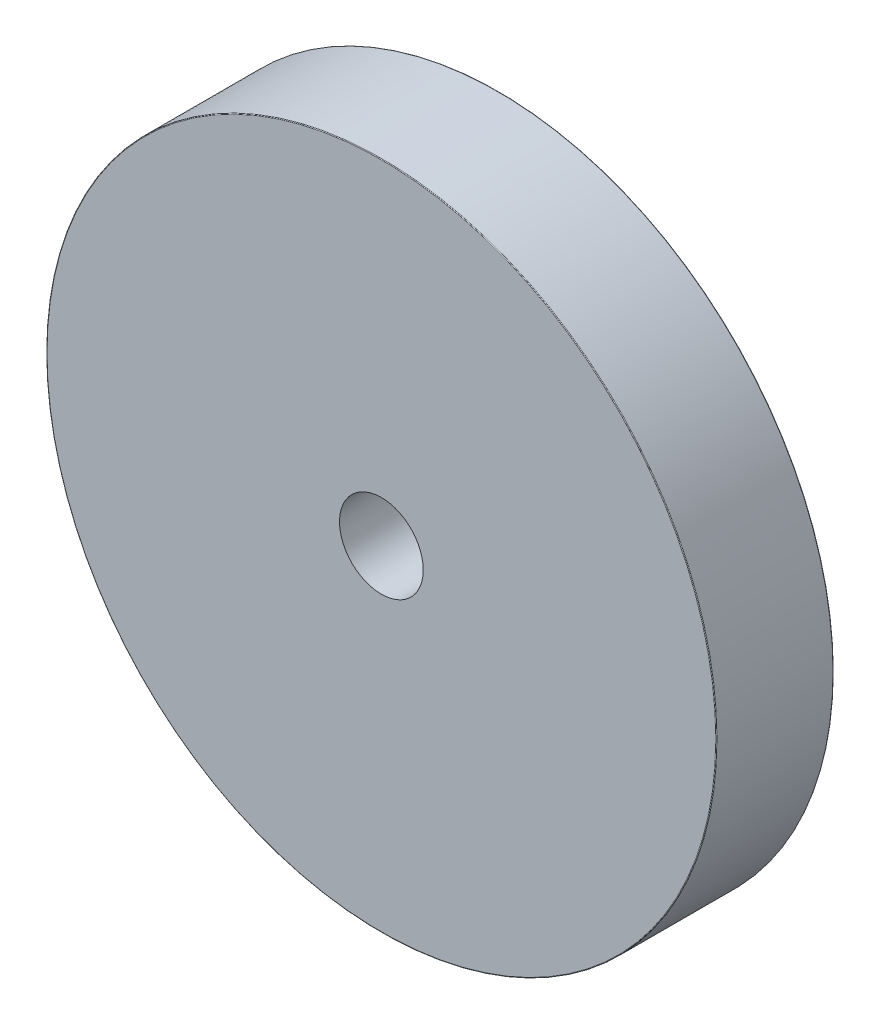
ISO-10303-21;
HEADER;
FILE_DESCRIPTION(('STEP AP214'),'2;1');
FILE_NAME('part.step','',(''),(''),'','','');
FILE_SCHEMA(('AUTOMOTIVE_DESIGN { 1 0 10303 214 1 1 1 1 }'));
ENDSEC;
DATA;
#1=APPLICATION_CONTEXT('core data for automotive mechanical design processes');
#2=APPLICATION_PROTOCOL_DEFINITION('international standard','automotive_design',2000,#1);
#3=PRODUCT_CONTEXT('',#1,'mechanical');
#4=PRODUCT('Part','Part','',(#3));
#5=PRODUCT_RELATED_PRODUCT_CATEGORY('part','',(#4));
#6=PRODUCT_DEFINITION_FORMATION('','',#4);
#7=PRODUCT_DEFINITION_CONTEXT('part definition',#1,'design');
#8=PRODUCT_DEFINITION('design','',#6,#7);
#9=PRODUCT_DEFINITION_SHAPE('','',#8);
#10=(LENGTH_UNIT() NAMED_UNIT(*) SI_UNIT(.MILLI.,.METRE.));
#11=(NAMED_UNIT(*) PLANE_ANGLE_UNIT() SI_UNIT($,.RADIAN.));
#12=(NAMED_UNIT(*) SI_UNIT($,.STERADIAN.) SOLID_ANGLE_UNIT());
#13=UNCERTAINTY_MEASURE_WITH_UNIT(LENGTH_MEASURE(1.E-05),#10,'distance_accuracy_value','');
#14=(GEOMETRIC_REPRESENTATION_CONTEXT(3) GLOBAL_UNCERTAINTY_ASSIGNED_CONTEXT((#13)) GLOBAL_UNIT_ASSIGNED_CONTEXT((#10,
#11,#12)) REPRESENTATION_CONTEXT('',''));
#15=CARTESIAN_POINT('',(0.,0.,0.));
#16=DIRECTION('',(0.,0.,1.));
#17=DIRECTION('',(1.,0.,0.));
#18=AXIS2_PLACEMENT_3D('',#15,#16,#17);
#19=CARTESIAN_POINT('',(0.,0.,4.445));
#20=DIRECTION('',(0.,0.,1.));
#21=DIRECTION('',(1.,0.,0.));
#22=AXIS2_PLACEMENT_3D('',#19,#20,#21);
#23=PLANE('',#22);
#24=CARTESIAN_POINT('',(0.,0.,4.445));
#25=DIRECTION('',(0.,0.,1.));
#26=DIRECTION('',(1.,0.,0.));
#27=AXIS2_PLACEMENT_3D('',#24,#25,#26);
#28=CIRCLE('',#27,12.6746);
#29=CARTESIAN_POINT('',(12.6746,0.,4.445));
#30=VERTEX_POINT('',#29);
#31=EDGE_CURVE('E10',#30,#30,#28,.T.);
#32=ORIENTED_EDGE('',*,*,#31,.T.);
#33=EDGE_LOOP('',(#32));
#34=FACE_BOUND('',#33,.T.);
#35=CARTESIAN_POINT('',(0.,0.,4.445));
#36=DIRECTION('',(0.,0.,1.));
#37=DIRECTION('',(1.,0.,0.));
#38=AXIS2_PLACEMENT_3D('',#35,#36,#37);
#39=CIRCLE('',#38,1.5875);
#40=CARTESIAN_POINT('',(1.5875,0.,4.445));
#41=VERTEX_POINT('',#40);
#42=EDGE_CURVE('E51',#41,#41,#39,.T.);
#43=ORIENTED_EDGE('',*,*,#42,.F.);
#44=EDGE_LOOP('',(#43));
#45=FACE_BOUND('',#44,.T.);
#46=ADVANCED_FACE('F31',(#34,#45),#23,.T.);
#47=CARTESIAN_POINT('',(0.,0.,0.));
#48=DIRECTION('',(0.,0.,1.));
#49=DIRECTION('',(1.,0.,0.));
#50=AXIS2_PLACEMENT_3D('',#47,#48,#49);
#51=PLANE('',#50);
#52=CARTESIAN_POINT('',(0.,0.,0.));
#53=DIRECTION('',(0.,0.,1.));
#54=DIRECTION('',(1.,0.,0.));
#55=AXIS2_PLACEMENT_3D('',#52,#53,#54);
#56=CIRCLE('',#55,12.6746);
#57=CARTESIAN_POINT('',(12.6746,0.,0.));
#58=VERTEX_POINT('',#57);
#59=EDGE_CURVE('E38',#58,#58,#56,.F.);
#60=ORIENTED_EDGE('',*,*,#59,.T.);
#61=EDGE_LOOP('',(#60));
#62=FACE_BOUND('',#61,.T.);
#63=CARTESIAN_POINT('',(0.,0.,0.));
#64=DIRECTION('',(0.,0.,1.));
#65=DIRECTION('',(1.,0.,0.));
#66=AXIS2_PLACEMENT_3D('',#63,#64,#65);
#67=CIRCLE('',#66,1.5875);
#68=CARTESIAN_POINT('',(1.5875,0.,0.));
#69=VERTEX_POINT('',#68);
#70=EDGE_CURVE('E52',#69,#69,#67,.T.);
#71=ORIENTED_EDGE('',*,*,#70,.T.);
#72=EDGE_LOOP('',(#71));
#73=FACE_BOUND('',#72,.T.);
#74=ADVANCED_FACE('F62',(#62,#73),#51,.F.);
#75=CARTESIAN_POINT('',(0.,0.,4.445));
#76=DIRECTION('',(0.,0.,-1.));
#77=DIRECTION('',(-1.,0.,0.));
#78=AXIS2_PLACEMENT_3D('',#75,#76,#77);
#79=CYLINDRICAL_SURFACE('',#78,12.7);
#80=CARTESIAN_POINT('',(0.,0.,0.0254000000000001));
#81=DIRECTION('',(0.,0.,1.));
#82=DIRECTION('',(1.,0.,0.));
#83=AXIS2_PLACEMENT_3D('',#80,#81,#82);
#84=CIRCLE('',#83,12.7);
#85=CARTESIAN_POINT('',(12.7,0.,0.0254000000000001));
#86=VERTEX_POINT('',#85);
#87=EDGE_CURVE('E42',#86,#86,#84,.T.);
#88=ORIENTED_EDGE('',*,*,#87,.T.);
#89=EDGE_LOOP('',(#88));
#90=FACE_BOUND('',#89,.T.);
#91=CARTESIAN_POINT('',(0.,0.,4.4196));
#92=DIRECTION('',(0.,0.,1.));
#93=DIRECTION('',(1.,0.,0.));
#94=AXIS2_PLACEMENT_3D('',#91,#92,#93);
#95=CIRCLE('',#94,12.7);
#96=CARTESIAN_POINT('',(12.7,0.,4.4196));
#97=VERTEX_POINT('',#96);
#98=EDGE_CURVE('E46',#97,#97,#95,.F.);
#99=ORIENTED_EDGE('',*,*,#98,.T.);
#100=EDGE_LOOP('',(#99));
#101=FACE_BOUND('',#100,.T.);
#102=ADVANCED_FACE('F67',(#90,#101),#79,.T.);
#103=CARTESIAN_POINT('',(0.,0.,4.445));
#104=DIRECTION('',(0.,0.,-1.));
#105=DIRECTION('',(-1.,0.,0.));
#106=AXIS2_PLACEMENT_3D('',#103,#104,#105);
#107=CYLINDRICAL_SURFACE('',#106,1.5875);
#108=ORIENTED_EDGE('',*,*,#42,.T.);
#109=EDGE_LOOP('',(#108));
#110=FACE_BOUND('',#109,.T.);
#111=ORIENTED_EDGE('',*,*,#70,.F.);
#112=EDGE_LOOP('',(#111));
#113=FACE_BOUND('',#112,.T.);
#114=ADVANCED_FACE('F58',(#110,#113),#107,.F.);
#115=CARTESIAN_POINT('',(0.,0.,0.0254000000000001));
#116=DIRECTION('',(0.,0.,1.));
#117=DIRECTION('',(1.,0.,0.));
#118=AXIS2_PLACEMENT_3D('',#115,#116,#117);
#119=TOROIDAL_SURFACE('',#118,12.6746,0.0254);
#120=ORIENTED_EDGE('',*,*,#59,.F.);
#121=EDGE_LOOP('',(#120));
#122=FACE_BOUND('',#121,.T.);
#123=ORIENTED_EDGE('',*,*,#87,.F.);
#124=EDGE_LOOP('',(#123));
#125=FACE_BOUND('',#124,.T.);
#126=ADVANCED_FACE('F73',(#122,#125),#119,.T.);
#127=CARTESIAN_POINT('',(0.,0.,4.4196));
#128=DIRECTION('',(0.,0.,1.));
#129=DIRECTION('',(1.,0.,0.));
#130=AXIS2_PLACEMENT_3D('',#127,#128,#129);
#131=TOROIDAL_SURFACE('',#130,12.6746,0.0254);
#132=ORIENTED_EDGE('',*,*,#98,.F.);
#133=EDGE_LOOP('',(#132));
#134=FACE_BOUND('',#133,.T.);
#135=ORIENTED_EDGE('',*,*,#31,.F.);
#136=EDGE_LOOP('',(#135));
#137=FACE_BOUND('',#136,.T.);
#138=ADVANCED_FACE('F33',(#134,#137),#131,.T.);
#139=CLOSED_SHELL('',(#46,#74,#102,#114,#126,#138));
#140=MANIFOLD_SOLID_BREP('B2',#139);
#141=ADVANCED_BREP_SHAPE_REPRESENTATION('',(#18,#140),#14);
#142=SHAPE_DEFINITION_REPRESENTATION(#9,#141);
ENDSEC;
END-ISO-10303-21;
